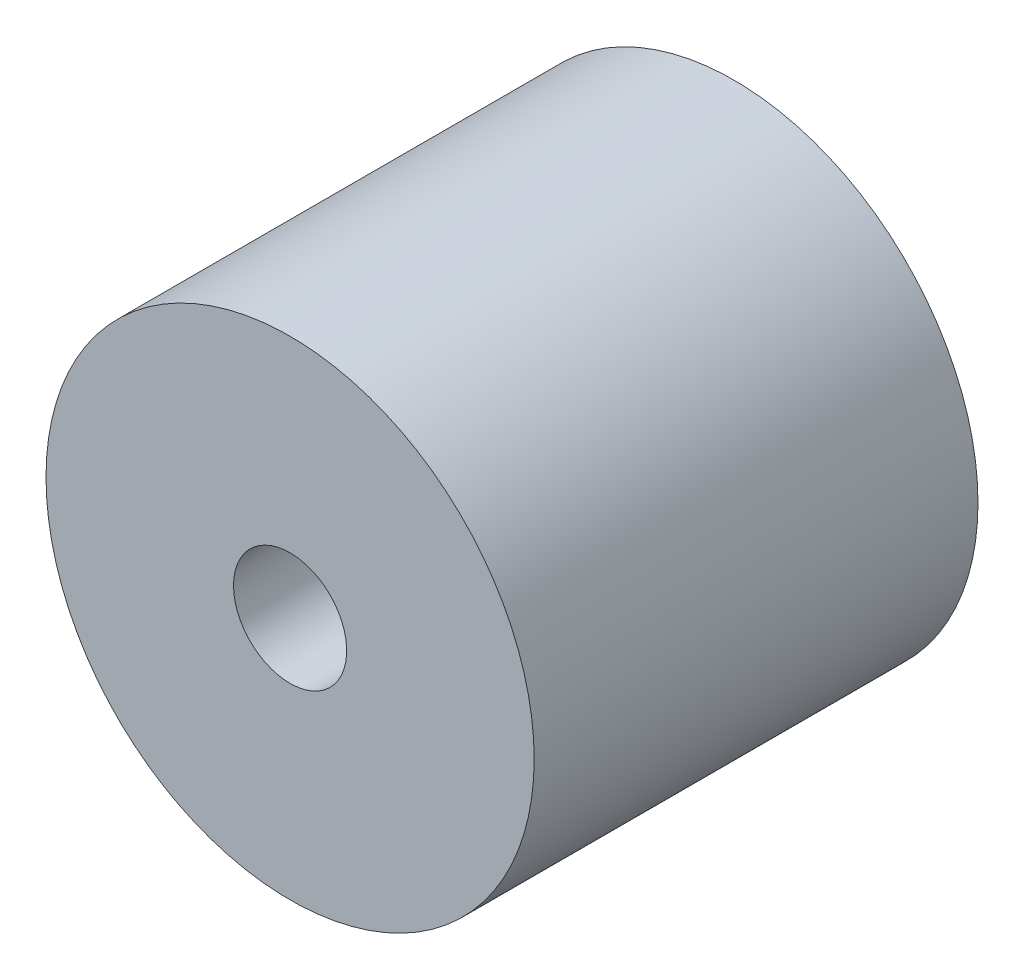
ISO-10303-21;
HEADER;
FILE_DESCRIPTION(('STEP AP214'),'2;1');
FILE_NAME('part.step','',(''),(''),'','','');
FILE_SCHEMA(('AUTOMOTIVE_DESIGN { 1 0 10303 214 1 1 1 1 }'));
ENDSEC;
DATA;
#1=APPLICATION_CONTEXT('core data for automotive mechanical design processes');
#2=APPLICATION_PROTOCOL_DEFINITION('international standard','automotive_design',2000,#1);
#3=PRODUCT_CONTEXT('',#1,'mechanical');
#4=PRODUCT('Part','Part','',(#3));
#5=PRODUCT_RELATED_PRODUCT_CATEGORY('part','',(#4));
#6=PRODUCT_DEFINITION_FORMATION('','',#4);
#7=PRODUCT_DEFINITION_CONTEXT('part definition',#1,'design');
#8=PRODUCT_DEFINITION('design','',#6,#7);
#9=PRODUCT_DEFINITION_SHAPE('','',#8);
#10=(LENGTH_UNIT() NAMED_UNIT(*) SI_UNIT(.MILLI.,.METRE.));
#11=(NAMED_UNIT(*) PLANE_ANGLE_UNIT() SI_UNIT($,.RADIAN.));
#12=(NAMED_UNIT(*) SI_UNIT($,.STERADIAN.) SOLID_ANGLE_UNIT());
#13=UNCERTAINTY_MEASURE_WITH_UNIT(LENGTH_MEASURE(1.E-05),#10,'distance_accuracy_value','');
#14=(GEOMETRIC_REPRESENTATION_CONTEXT(3) GLOBAL_UNCERTAINTY_ASSIGNED_CONTEXT((#13)) GLOBAL_UNIT_ASSIGNED_CONTEXT((#10,
#11,#12)) REPRESENTATION_CONTEXT('',''));
#15=CARTESIAN_POINT('',(0.,0.,0.));
#16=DIRECTION('',(0.,0.,1.));
#17=DIRECTION('',(1.,0.,0.));
#18=AXIS2_PLACEMENT_3D('',#15,#16,#17);
#19=CARTESIAN_POINT('',(0.,0.,20.));
#20=DIRECTION('',(0.,0.,-1.));
#21=DIRECTION('',(-1.,0.,0.));
#22=AXIS2_PLACEMENT_3D('',#19,#20,#21);
#23=CYLINDRICAL_SURFACE('',#22,11.);
#24=CARTESIAN_POINT('',(0.,0.,20.));
#25=DIRECTION('',(0.,0.,1.));
#26=DIRECTION('',(1.,0.,0.));
#27=AXIS2_PLACEMENT_3D('',#24,#25,#26);
#28=CIRCLE('',#27,11.);
#29=CARTESIAN_POINT('',(11.,0.,20.));
#30=VERTEX_POINT('',#29);
#31=EDGE_CURVE('E10',#30,#30,#28,.T.);
#32=ORIENTED_EDGE('',*,*,#31,.F.);
#33=EDGE_LOOP('',(#32));
#34=FACE_BOUND('',#33,.T.);
#35=CARTESIAN_POINT('',(0.,0.,0.));
#36=DIRECTION('',(0.,0.,1.));
#37=DIRECTION('',(1.,0.,0.));
#38=AXIS2_PLACEMENT_3D('',#35,#36,#37);
#39=CIRCLE('',#38,11.);
#40=CARTESIAN_POINT('',(11.,0.,0.));
#41=VERTEX_POINT('',#40);
#42=EDGE_CURVE('E42',#41,#41,#39,.T.);
#43=ORIENTED_EDGE('',*,*,#42,.T.);
#44=EDGE_LOOP('',(#43));
#45=FACE_BOUND('',#44,.T.);
#46=ADVANCED_FACE('F39',(#34,#45),#23,.T.);
#47=CARTESIAN_POINT('',(0.,0.,20.));
#48=DIRECTION('',(0.,0.,1.));
#49=DIRECTION('',(1.,0.,0.));
#50=AXIS2_PLACEMENT_3D('',#47,#48,#49);
#51=PLANE('',#50);
#52=CARTESIAN_POINT('',(0.,0.,20.));
#53=DIRECTION('',(0.,0.,-1.));
#54=DIRECTION('',(-1.,0.,0.));
#55=AXIS2_PLACEMENT_3D('',#52,#53,#54);
#56=CIRCLE('',#55,2.55);
#57=CARTESIAN_POINT('',(-2.55,0.,20.));
#58=VERTEX_POINT('',#57);
#59=EDGE_CURVE('E49',#58,#58,#56,.T.);
#60=ORIENTED_EDGE('',*,*,#59,.T.);
#61=EDGE_LOOP('',(#60));
#62=FACE_BOUND('',#61,.T.);
#63=ORIENTED_EDGE('',*,*,#31,.T.);
#64=EDGE_LOOP('',(#63));
#65=FACE_BOUND('',#64,.T.);
#66=ADVANCED_FACE('F57',(#62,#65),#51,.T.);
#67=CARTESIAN_POINT('',(0.,0.,0.));
#68=DIRECTION('',(0.,0.,1.));
#69=DIRECTION('',(1.,0.,0.));
#70=AXIS2_PLACEMENT_3D('',#67,#68,#69);
#71=PLANE('',#70);
#72=CARTESIAN_POINT('',(0.,0.,0.));
#73=DIRECTION('',(0.,0.,-1.));
#74=DIRECTION('',(-1.,0.,0.));
#75=AXIS2_PLACEMENT_3D('',#72,#73,#74);
#76=CIRCLE('',#75,2.55);
#77=CARTESIAN_POINT('',(-2.55,0.,0.));
#78=VERTEX_POINT('',#77);
#79=EDGE_CURVE('E51',#78,#78,#76,.T.);
#80=ORIENTED_EDGE('',*,*,#79,.F.);
#81=EDGE_LOOP('',(#80));
#82=FACE_BOUND('',#81,.T.);
#83=ORIENTED_EDGE('',*,*,#42,.F.);
#84=EDGE_LOOP('',(#83));
#85=FACE_BOUND('',#84,.T.);
#86=ADVANCED_FACE('F62',(#82,#85),#71,.F.);
#87=CARTESIAN_POINT('',(0.,0.,20.));
#88=DIRECTION('',(0.,0.,-1.));
#89=DIRECTION('',(-1.,0.,0.));
#90=AXIS2_PLACEMENT_3D('',#87,#88,#89);
#91=CYLINDRICAL_SURFACE('',#90,2.55);
#92=ORIENTED_EDGE('',*,*,#59,.F.);
#93=EDGE_LOOP('',(#92));
#94=FACE_BOUND('',#93,.T.);
#95=ORIENTED_EDGE('',*,*,#79,.T.);
#96=EDGE_LOOP('',(#95));
#97=FACE_BOUND('',#96,.T.);
#98=ADVANCED_FACE('F59',(#94,#97),#91,.F.);
#99=CLOSED_SHELL('',(#46,#66,#86,#98));
#100=MANIFOLD_SOLID_BREP('B2',#99);
#101=ADVANCED_BREP_SHAPE_REPRESENTATION('',(#18,#100),#14);
#102=SHAPE_DEFINITION_REPRESENTATION(#9,#101);
ENDSEC;
END-ISO-10303-21;
